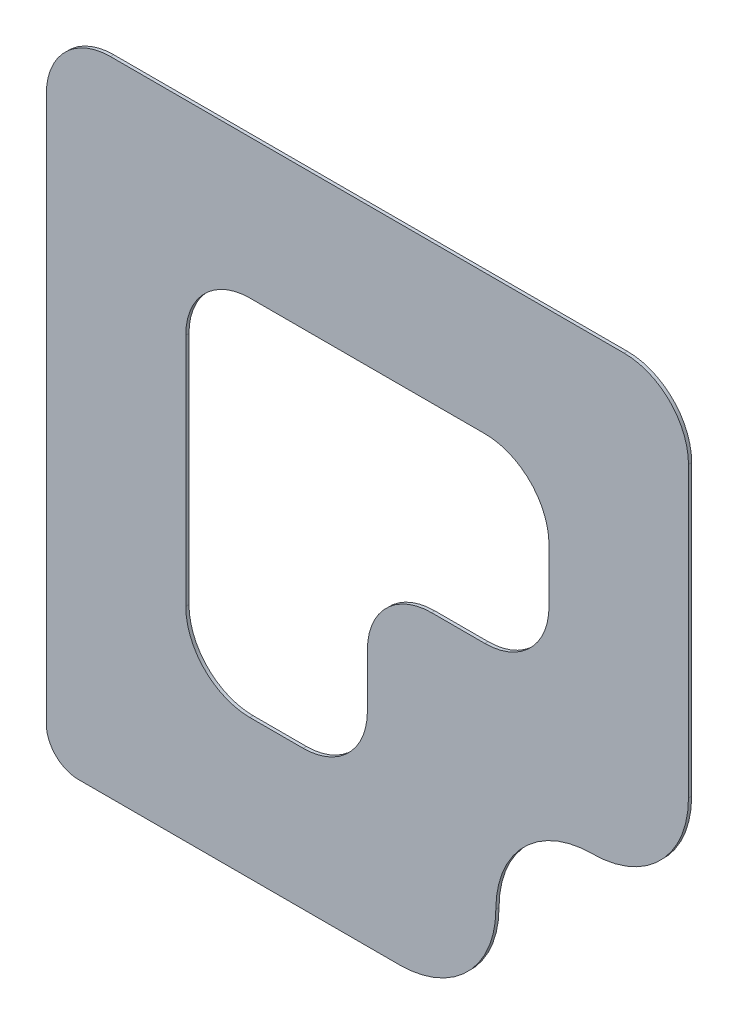
ISO-10303-21;
HEADER;
FILE_DESCRIPTION(('STEP AP214'),'2;1');
FILE_NAME('part.step','',(''),(''),'','','');
FILE_SCHEMA(('AUTOMOTIVE_DESIGN { 1 0 10303 214 1 1 1 1 }'));
ENDSEC;
DATA;
#1=APPLICATION_CONTEXT('core data for automotive mechanical design processes');
#2=APPLICATION_PROTOCOL_DEFINITION('international standard','automotive_design',2000,#1);
#3=PRODUCT_CONTEXT('',#1,'mechanical');
#4=PRODUCT('Part','Part','',(#3));
#5=PRODUCT_RELATED_PRODUCT_CATEGORY('part','',(#4));
#6=PRODUCT_DEFINITION_FORMATION('','',#4);
#7=PRODUCT_DEFINITION_CONTEXT('part definition',#1,'design');
#8=PRODUCT_DEFINITION('design','',#6,#7);
#9=PRODUCT_DEFINITION_SHAPE('','',#8);
#10=(LENGTH_UNIT() NAMED_UNIT(*) SI_UNIT(.MILLI.,.METRE.));
#11=(NAMED_UNIT(*) PLANE_ANGLE_UNIT() SI_UNIT($,.RADIAN.));
#12=(NAMED_UNIT(*) SI_UNIT($,.STERADIAN.) SOLID_ANGLE_UNIT());
#13=UNCERTAINTY_MEASURE_WITH_UNIT(LENGTH_MEASURE(1.E-05),#10,'distance_accuracy_value','');
#14=(GEOMETRIC_REPRESENTATION_CONTEXT(3) GLOBAL_UNCERTAINTY_ASSIGNED_CONTEXT((#13)) GLOBAL_UNIT_ASSIGNED_CONTEXT((#10,
#11,#12)) REPRESENTATION_CONTEXT('',''));
#15=CARTESIAN_POINT('',(0.,0.,0.));
#16=DIRECTION('',(0.,0.,1.));
#17=DIRECTION('',(1.,0.,0.));
#18=AXIS2_PLACEMENT_3D('',#15,#16,#17);
#19=CARTESIAN_POINT('',(20.5,23.,0.1));
#20=DIRECTION('',(0.,0.,1.));
#21=DIRECTION('',(1.,0.,0.));
#22=AXIS2_PLACEMENT_3D('',#19,#20,#21);
#23=PLANE('',#22);
#24=CARTESIAN_POINT('',(20.5,23.,0.1));
#25=DIRECTION('',(0.,0.,1.));
#26=DIRECTION('',(1.,0.,0.));
#27=AXIS2_PLACEMENT_3D('',#24,#25,#26);
#28=CIRCLE('',#27,1.);
#29=CARTESIAN_POINT('',(19.5,23.,0.1));
#30=VERTEX_POINT('',#29);
#31=CARTESIAN_POINT('',(20.5,22.,0.1));
#32=VERTEX_POINT('',#31);
#33=EDGE_CURVE('E275',#30,#32,#28,.T.);
#34=ORIENTED_EDGE('',*,*,#33,.T.);
#35=DIRECTION('',(1.,0.,0.));
#36=VECTOR('',#35,1.);
#37=CARTESIAN_POINT('',(20.5,22.,0.1));
#38=LINE('',#37,#36);
#39=CARTESIAN_POINT('',(30.5,22.,0.1));
#40=VERTEX_POINT('',#39);
#41=EDGE_CURVE('E278',#32,#40,#38,.T.);
#42=ORIENTED_EDGE('',*,*,#41,.T.);
#43=CARTESIAN_POINT('',(30.5,25.,0.1));
#44=DIRECTION('',(0.,0.,1.));
#45=DIRECTION('',(1.,0.,0.));
#46=AXIS2_PLACEMENT_3D('',#43,#44,#45);
#47=CIRCLE('',#46,3.);
#48=CARTESIAN_POINT('',(33.5,25.,0.1));
#49=VERTEX_POINT('',#48);
#50=EDGE_CURVE('E281',#40,#49,#47,.T.);
#51=ORIENTED_EDGE('',*,*,#50,.T.);
#52=CARTESIAN_POINT('',(36.5,25.,0.1));
#53=DIRECTION('',(0.,0.,-1.));
#54=DIRECTION('',(1.,0.,0.));
#55=AXIS2_PLACEMENT_3D('',#52,#53,#54);
#56=CIRCLE('',#55,3.);
#57=CARTESIAN_POINT('',(36.5,28.,0.1));
#58=VERTEX_POINT('',#57);
#59=EDGE_CURVE('E283',#49,#58,#56,.T.);
#60=ORIENTED_EDGE('',*,*,#59,.T.);
#61=CARTESIAN_POINT('',(36.5,31.,0.1));
#62=DIRECTION('',(0.,0.,1.));
#63=DIRECTION('',(1.,0.,0.));
#64=AXIS2_PLACEMENT_3D('',#61,#62,#63);
#65=CIRCLE('',#64,3.);
#66=CARTESIAN_POINT('',(39.5,31.,0.1));
#67=VERTEX_POINT('',#66);
#68=EDGE_CURVE('E285',#58,#67,#65,.T.);
#69=ORIENTED_EDGE('',*,*,#68,.T.);
#70=DIRECTION('',(0.,1.,0.));
#71=VECTOR('',#70,1.);
#72=CARTESIAN_POINT('',(39.5,31.,0.1));
#73=LINE('',#72,#71);
#74=CARTESIAN_POINT('',(39.5,40.,0.1));
#75=VERTEX_POINT('',#74);
#76=EDGE_CURVE('E287',#67,#75,#73,.T.);
#77=ORIENTED_EDGE('',*,*,#76,.T.);
#78=CARTESIAN_POINT('',(37.5,40.,0.1));
#79=DIRECTION('',(0.,0.,1.));
#80=DIRECTION('',(1.,0.,0.));
#81=AXIS2_PLACEMENT_3D('',#78,#79,#80);
#82=CIRCLE('',#81,2.);
#83=CARTESIAN_POINT('',(37.5,42.,0.1));
#84=VERTEX_POINT('',#83);
#85=EDGE_CURVE('E289',#75,#84,#82,.T.);
#86=ORIENTED_EDGE('',*,*,#85,.T.);
#87=DIRECTION('',(-1.,0.,0.));
#88=VECTOR('',#87,1.);
#89=CARTESIAN_POINT('',(37.5,42.,0.1));
#90=LINE('',#89,#88);
#91=CARTESIAN_POINT('',(21.5,42.,0.1));
#92=VERTEX_POINT('',#91);
#93=EDGE_CURVE('E291',#84,#92,#90,.T.);
#94=ORIENTED_EDGE('',*,*,#93,.T.);
#95=CARTESIAN_POINT('',(21.5,40.,0.1));
#96=DIRECTION('',(0.,0.,1.));
#97=DIRECTION('',(1.,0.,0.));
#98=AXIS2_PLACEMENT_3D('',#95,#96,#97);
#99=CIRCLE('',#98,2.);
#100=CARTESIAN_POINT('',(19.5,40.,0.1));
#101=VERTEX_POINT('',#100);
#102=EDGE_CURVE('E293',#92,#101,#99,.T.);
#103=ORIENTED_EDGE('',*,*,#102,.T.);
#104=DIRECTION('',(0.,-1.,0.));
#105=VECTOR('',#104,1.);
#106=CARTESIAN_POINT('',(19.5,40.,0.1));
#107=LINE('',#106,#105);
#108=EDGE_CURVE('E295',#101,#30,#107,.T.);
#109=ORIENTED_EDGE('',*,*,#108,.T.);
#110=EDGE_LOOP('',(#34,#42,#51,#60,#69,#77,#86,#94,#103,#109));
#111=FACE_BOUND('',#110,.T.);
#112=DIRECTION('',(0.,-1.,0.));
#113=VECTOR('',#112,1.);
#114=CARTESIAN_POINT('',(23.8431457505076,35.6568542494924,0.1));
#115=LINE('',#114,#113);
#116=CARTESIAN_POINT('',(23.8431457505076,35.6568542494924,0.1));
#117=VERTEX_POINT('',#116);
#118=CARTESIAN_POINT('',(23.8431457505076,28.3431457505076,0.1));
#119=VERTEX_POINT('',#118);
#120=EDGE_CURVE('E190',#117,#119,#115,.T.);
#121=ORIENTED_EDGE('',*,*,#120,.F.);
#122=CARTESIAN_POINT('',(25.8431457505076,35.6568542494924,0.1));
#123=DIRECTION('',(0.,0.,1.));
#124=DIRECTION('',(1.,0.,0.));
#125=AXIS2_PLACEMENT_3D('',#122,#123,#124);
#126=CIRCLE('',#125,2.);
#127=CARTESIAN_POINT('',(25.8431457505076,37.6568542494924,0.1));
#128=VERTEX_POINT('',#127);
#129=EDGE_CURVE('E182',#128,#117,#126,.T.);
#130=ORIENTED_EDGE('',*,*,#129,.F.);
#131=DIRECTION('',(-1.,0.,0.));
#132=VECTOR('',#131,1.);
#133=CARTESIAN_POINT('',(33.1568542494924,37.6568542494924,0.1));
#134=LINE('',#133,#132);
#135=CARTESIAN_POINT('',(33.1568542494924,37.6568542494924,0.1));
#136=VERTEX_POINT('',#135);
#137=EDGE_CURVE('E223',#136,#128,#134,.T.);
#138=ORIENTED_EDGE('',*,*,#137,.F.);
#139=CARTESIAN_POINT('',(33.1568542494924,35.6568542494924,0.1));
#140=DIRECTION('',(0.,0.,1.));
#141=DIRECTION('',(1.,0.,0.));
#142=AXIS2_PLACEMENT_3D('',#139,#140,#141);
#143=CIRCLE('',#142,2.);
#144=CARTESIAN_POINT('',(35.1568542494924,35.6568542494924,0.1));
#145=VERTEX_POINT('',#144);
#146=EDGE_CURVE('E221',#145,#136,#143,.T.);
#147=ORIENTED_EDGE('',*,*,#146,.F.);
#148=DIRECTION('',(0.,1.,0.));
#149=VECTOR('',#148,1.);
#150=CARTESIAN_POINT('',(35.1568542494924,34.,0.1));
#151=LINE('',#150,#149);
#152=CARTESIAN_POINT('',(35.1568542494924,34.,0.1));
#153=VERTEX_POINT('',#152);
#154=EDGE_CURVE('E219',#153,#145,#151,.T.);
#155=ORIENTED_EDGE('',*,*,#154,.F.);
#156=CARTESIAN_POINT('',(33.1568542494924,34.,0.1));
#157=DIRECTION('',(0.,0.,1.));
#158=DIRECTION('',(1.,0.,0.));
#159=AXIS2_PLACEMENT_3D('',#156,#157,#158);
#160=CIRCLE('',#159,2.);
#161=CARTESIAN_POINT('',(33.1568542494924,32.,0.1));
#162=VERTEX_POINT('',#161);
#163=EDGE_CURVE('E217',#162,#153,#160,.T.);
#164=ORIENTED_EDGE('',*,*,#163,.F.);
#165=DIRECTION('',(1.,0.,0.));
#166=VECTOR('',#165,1.);
#167=CARTESIAN_POINT('',(31.5,32.,0.1));
#168=LINE('',#167,#166);
#169=CARTESIAN_POINT('',(31.5,32.,0.1));
#170=VERTEX_POINT('',#169);
#171=EDGE_CURVE('E215',#170,#162,#168,.T.);
#172=ORIENTED_EDGE('',*,*,#171,.F.);
#173=CARTESIAN_POINT('',(31.5,30.,0.1));
#174=DIRECTION('',(0.,0.,-1.));
#175=DIRECTION('',(1.,0.,0.));
#176=AXIS2_PLACEMENT_3D('',#173,#174,#175);
#177=CIRCLE('',#176,2.);
#178=CARTESIAN_POINT('',(29.5,30.,0.1));
#179=VERTEX_POINT('',#178);
#180=EDGE_CURVE('E213',#179,#170,#177,.T.);
#181=ORIENTED_EDGE('',*,*,#180,.F.);
#182=DIRECTION('',(0.,1.,0.));
#183=VECTOR('',#182,1.);
#184=CARTESIAN_POINT('',(29.5,30.,0.1));
#185=LINE('',#184,#183);
#186=CARTESIAN_POINT('',(29.5,28.3431457505076,0.1));
#187=VERTEX_POINT('',#186);
#188=EDGE_CURVE('E211',#187,#179,#185,.T.);
#189=ORIENTED_EDGE('',*,*,#188,.F.);
#190=CARTESIAN_POINT('',(27.5,28.3431457505076,0.1));
#191=DIRECTION('',(0.,0.,1.));
#192=DIRECTION('',(1.,0.,0.));
#193=AXIS2_PLACEMENT_3D('',#190,#191,#192);
#194=CIRCLE('',#193,2.);
#195=CARTESIAN_POINT('',(27.5,26.3431457505076,0.1));
#196=VERTEX_POINT('',#195);
#197=EDGE_CURVE('E209',#196,#187,#194,.T.);
#198=ORIENTED_EDGE('',*,*,#197,.F.);
#199=DIRECTION('',(1.,0.,0.));
#200=VECTOR('',#199,1.);
#201=CARTESIAN_POINT('',(25.8431457505076,26.3431457505076,0.1));
#202=LINE('',#201,#200);
#203=CARTESIAN_POINT('',(25.8431457505076,26.3431457505076,0.1));
#204=VERTEX_POINT('',#203);
#205=EDGE_CURVE('E205',#204,#196,#202,.T.);
#206=ORIENTED_EDGE('',*,*,#205,.F.);
#207=CARTESIAN_POINT('',(25.8431457505076,28.3431457505076,0.1));
#208=DIRECTION('',(0.,0.,1.));
#209=DIRECTION('',(1.,0.,0.));
#210=AXIS2_PLACEMENT_3D('',#207,#208,#209);
#211=CIRCLE('',#210,2.);
#212=EDGE_CURVE('E203',#119,#204,#211,.T.);
#213=ORIENTED_EDGE('',*,*,#212,.F.);
#214=EDGE_LOOP('',(#121,#130,#138,#147,#155,#164,#172,#181,#189,#198,#206,#213));
#215=FACE_BOUND('',#214,.T.);
#216=ADVANCED_FACE('F33',(#111,#215),#23,.T.);
#217=CARTESIAN_POINT('',(20.5,23.,0.));
#218=DIRECTION('',(0.,0.,1.));
#219=DIRECTION('',(1.,0.,0.));
#220=AXIS2_PLACEMENT_3D('',#217,#218,#219);
#221=PLANE('',#220);
#222=CARTESIAN_POINT('',(20.5,23.,0.));
#223=DIRECTION('',(0.,0.,1.));
#224=DIRECTION('',(1.,0.,0.));
#225=AXIS2_PLACEMENT_3D('',#222,#223,#224);
#226=CIRCLE('',#225,1.);
#227=CARTESIAN_POINT('',(19.5,23.,0.));
#228=VERTEX_POINT('',#227);
#229=CARTESIAN_POINT('',(20.5,22.,0.));
#230=VERTEX_POINT('',#229);
#231=EDGE_CURVE('E198',#228,#230,#226,.T.);
#232=ORIENTED_EDGE('',*,*,#231,.F.);
#233=DIRECTION('',(0.,-1.,0.));
#234=VECTOR('',#233,1.);
#235=CARTESIAN_POINT('',(19.5,40.,0.));
#236=LINE('',#235,#234);
#237=CARTESIAN_POINT('',(19.5,40.,0.));
#238=VERTEX_POINT('',#237);
#239=EDGE_CURVE('E279',#238,#228,#236,.T.);
#240=ORIENTED_EDGE('',*,*,#239,.F.);
#241=CARTESIAN_POINT('',(21.5,40.,0.));
#242=DIRECTION('',(0.,0.,1.));
#243=DIRECTION('',(1.,0.,0.));
#244=AXIS2_PLACEMENT_3D('',#241,#242,#243);
#245=CIRCLE('',#244,2.);
#246=CARTESIAN_POINT('',(21.5,42.,0.));
#247=VERTEX_POINT('',#246);
#248=EDGE_CURVE('E315',#247,#238,#245,.T.);
#249=ORIENTED_EDGE('',*,*,#248,.F.);
#250=DIRECTION('',(-1.,0.,0.));
#251=VECTOR('',#250,1.);
#252=CARTESIAN_POINT('',(37.5,42.,0.));
#253=LINE('',#252,#251);
#254=CARTESIAN_POINT('',(37.5,42.,0.));
#255=VERTEX_POINT('',#254);
#256=EDGE_CURVE('E313',#255,#247,#253,.T.);
#257=ORIENTED_EDGE('',*,*,#256,.F.);
#258=CARTESIAN_POINT('',(37.5,40.,0.));
#259=DIRECTION('',(0.,0.,1.));
#260=DIRECTION('',(1.,0.,0.));
#261=AXIS2_PLACEMENT_3D('',#258,#259,#260);
#262=CIRCLE('',#261,2.);
#263=CARTESIAN_POINT('',(39.5,40.,0.));
#264=VERTEX_POINT('',#263);
#265=EDGE_CURVE('E311',#264,#255,#262,.T.);
#266=ORIENTED_EDGE('',*,*,#265,.F.);
#267=DIRECTION('',(0.,1.,0.));
#268=VECTOR('',#267,1.);
#269=CARTESIAN_POINT('',(39.5,33.,0.));
#270=LINE('',#269,#268);
#271=CARTESIAN_POINT('',(39.5,31.,0.));
#272=VERTEX_POINT('',#271);
#273=EDGE_CURVE('E309',#272,#264,#270,.T.);
#274=ORIENTED_EDGE('',*,*,#273,.F.);
#275=CARTESIAN_POINT('',(36.5,31.,0.));
#276=DIRECTION('',(0.,0.,1.));
#277=DIRECTION('',(1.,0.,0.));
#278=AXIS2_PLACEMENT_3D('',#275,#276,#277);
#279=CIRCLE('',#278,3.);
#280=CARTESIAN_POINT('',(36.5,28.,0.));
#281=VERTEX_POINT('',#280);
#282=EDGE_CURVE('E306',#281,#272,#279,.T.);
#283=ORIENTED_EDGE('',*,*,#282,.F.);
#284=CARTESIAN_POINT('',(36.5,25.,0.));
#285=DIRECTION('',(0.,0.,-1.));
#286=DIRECTION('',(1.,0.,0.));
#287=AXIS2_PLACEMENT_3D('',#284,#285,#286);
#288=CIRCLE('',#287,3.);
#289=CARTESIAN_POINT('',(33.5,25.,0.));
#290=VERTEX_POINT('',#289);
#291=EDGE_CURVE('E304',#290,#281,#288,.T.);
#292=ORIENTED_EDGE('',*,*,#291,.F.);
#293=CARTESIAN_POINT('',(30.5,25.,0.));
#294=DIRECTION('',(0.,0.,1.));
#295=DIRECTION('',(1.,0.,0.));
#296=AXIS2_PLACEMENT_3D('',#293,#294,#295);
#297=CIRCLE('',#296,3.);
#298=CARTESIAN_POINT('',(30.5,22.,0.));
#299=VERTEX_POINT('',#298);
#300=EDGE_CURVE('E302',#299,#290,#297,.T.);
#301=ORIENTED_EDGE('',*,*,#300,.F.);
#302=DIRECTION('',(1.,0.,0.));
#303=VECTOR('',#302,1.);
#304=CARTESIAN_POINT('',(30.5,22.,0.));
#305=LINE('',#304,#303);
#306=EDGE_CURVE('E300',#230,#299,#305,.T.);
#307=ORIENTED_EDGE('',*,*,#306,.F.);
#308=EDGE_LOOP('',(#232,#240,#249,#257,#266,#274,#283,#292,#301,#307));
#309=FACE_BOUND('',#308,.T.);
#310=CARTESIAN_POINT('',(25.8431457505076,35.6568542494924,0.));
#311=DIRECTION('',(0.,0.,1.));
#312=DIRECTION('',(1.,0.,0.));
#313=AXIS2_PLACEMENT_3D('',#310,#311,#312);
#314=CIRCLE('',#313,2.);
#315=CARTESIAN_POINT('',(25.8431457505076,37.6568542494924,0.));
#316=VERTEX_POINT('',#315);
#317=CARTESIAN_POINT('',(23.8431457505076,35.6568542494924,0.));
#318=VERTEX_POINT('',#317);
#319=EDGE_CURVE('E56',#316,#318,#314,.T.);
#320=ORIENTED_EDGE('',*,*,#319,.T.);
#321=DIRECTION('',(0.,-1.,0.));
#322=VECTOR('',#321,1.);
#323=CARTESIAN_POINT('',(23.8431457505076,35.6568542494924,0.));
#324=LINE('',#323,#322);
#325=CARTESIAN_POINT('',(23.8431457505076,28.3431457505076,0.));
#326=VERTEX_POINT('',#325);
#327=EDGE_CURVE('E197',#318,#326,#324,.T.);
#328=ORIENTED_EDGE('',*,*,#327,.T.);
#329=CARTESIAN_POINT('',(25.8431457505076,28.3431457505076,0.));
#330=DIRECTION('',(0.,0.,1.));
#331=DIRECTION('',(1.,0.,0.));
#332=AXIS2_PLACEMENT_3D('',#329,#330,#331);
#333=CIRCLE('',#332,2.);
#334=CARTESIAN_POINT('',(25.8431457505076,26.3431457505076,0.));
#335=VERTEX_POINT('',#334);
#336=EDGE_CURVE('E227',#326,#335,#333,.T.);
#337=ORIENTED_EDGE('',*,*,#336,.T.);
#338=DIRECTION('',(1.,0.,0.));
#339=VECTOR('',#338,1.);
#340=CARTESIAN_POINT('',(25.8431457505076,26.3431457505076,0.));
#341=LINE('',#340,#339);
#342=CARTESIAN_POINT('',(27.5,26.3431457505076,0.));
#343=VERTEX_POINT('',#342);
#344=EDGE_CURVE('E230',#335,#343,#341,.T.);
#345=ORIENTED_EDGE('',*,*,#344,.T.);
#346=CARTESIAN_POINT('',(27.5,28.3431457505076,0.));
#347=DIRECTION('',(0.,0.,1.));
#348=DIRECTION('',(1.,0.,0.));
#349=AXIS2_PLACEMENT_3D('',#346,#347,#348);
#350=CIRCLE('',#349,2.);
#351=CARTESIAN_POINT('',(29.5,28.3431457505076,0.));
#352=VERTEX_POINT('',#351);
#353=EDGE_CURVE('E233',#343,#352,#350,.T.);
#354=ORIENTED_EDGE('',*,*,#353,.T.);
#355=DIRECTION('',(0.,1.,0.));
#356=VECTOR('',#355,1.);
#357=CARTESIAN_POINT('',(29.5,30.,0.));
#358=LINE('',#357,#356);
#359=CARTESIAN_POINT('',(29.5,30.,0.));
#360=VERTEX_POINT('',#359);
#361=EDGE_CURVE('E236',#352,#360,#358,.T.);
#362=ORIENTED_EDGE('',*,*,#361,.T.);
#363=CARTESIAN_POINT('',(31.5,30.,0.));
#364=DIRECTION('',(0.,0.,-1.));
#365=DIRECTION('',(1.,0.,0.));
#366=AXIS2_PLACEMENT_3D('',#363,#364,#365);
#367=CIRCLE('',#366,2.);
#368=CARTESIAN_POINT('',(31.5,32.,0.));
#369=VERTEX_POINT('',#368);
#370=EDGE_CURVE('E239',#360,#369,#367,.T.);
#371=ORIENTED_EDGE('',*,*,#370,.T.);
#372=DIRECTION('',(1.,0.,0.));
#373=VECTOR('',#372,1.);
#374=CARTESIAN_POINT('',(31.5,32.,0.));
#375=LINE('',#374,#373);
#376=CARTESIAN_POINT('',(33.1568542494924,32.,0.));
#377=VERTEX_POINT('',#376);
#378=EDGE_CURVE('E242',#369,#377,#375,.T.);
#379=ORIENTED_EDGE('',*,*,#378,.T.);
#380=CARTESIAN_POINT('',(33.1568542494924,34.,0.));
#381=DIRECTION('',(0.,0.,1.));
#382=DIRECTION('',(1.,0.,0.));
#383=AXIS2_PLACEMENT_3D('',#380,#381,#382);
#384=CIRCLE('',#383,2.);
#385=CARTESIAN_POINT('',(35.1568542494924,34.,0.));
#386=VERTEX_POINT('',#385);
#387=EDGE_CURVE('E245',#377,#386,#384,.T.);
#388=ORIENTED_EDGE('',*,*,#387,.T.);
#389=DIRECTION('',(0.,1.,0.));
#390=VECTOR('',#389,1.);
#391=CARTESIAN_POINT('',(35.1568542494924,34.,0.));
#392=LINE('',#391,#390);
#393=CARTESIAN_POINT('',(35.1568542494924,35.6568542494924,0.));
#394=VERTEX_POINT('',#393);
#395=EDGE_CURVE('E248',#386,#394,#392,.T.);
#396=ORIENTED_EDGE('',*,*,#395,.T.);
#397=CARTESIAN_POINT('',(33.1568542494924,35.6568542494924,0.));
#398=DIRECTION('',(0.,0.,1.));
#399=DIRECTION('',(1.,0.,0.));
#400=AXIS2_PLACEMENT_3D('',#397,#398,#399);
#401=CIRCLE('',#400,2.);
#402=CARTESIAN_POINT('',(33.1568542494924,37.6568542494924,0.));
#403=VERTEX_POINT('',#402);
#404=EDGE_CURVE('E251',#394,#403,#401,.T.);
#405=ORIENTED_EDGE('',*,*,#404,.T.);
#406=DIRECTION('',(-1.,0.,0.));
#407=VECTOR('',#406,1.);
#408=CARTESIAN_POINT('',(33.1568542494924,37.6568542494924,0.));
#409=LINE('',#408,#407);
#410=EDGE_CURVE('E191',#403,#316,#409,.T.);
#411=ORIENTED_EDGE('',*,*,#410,.T.);
#412=EDGE_LOOP('',(#320,#328,#337,#345,#354,#362,#371,#379,#388,#396,#405,#411));
#413=FACE_BOUND('',#412,.T.);
#414=ADVANCED_FACE('F351',(#309,#413),#221,.F.);
#415=CARTESIAN_POINT('',(20.5,23.,0.1));
#416=DIRECTION('',(0.,0.,-1.));
#417=DIRECTION('',(-1.,0.,0.));
#418=AXIS2_PLACEMENT_3D('',#415,#416,#417);
#419=CYLINDRICAL_SURFACE('',#418,1.);
#420=ORIENTED_EDGE('',*,*,#231,.T.);
#421=DIRECTION('',(0.,0.,-1.));
#422=VECTOR('',#421,1.);
#423=CARTESIAN_POINT('',(20.5,22.,0.1));
#424=LINE('',#423,#422);
#425=EDGE_CURVE('E11',#32,#230,#424,.T.);
#426=ORIENTED_EDGE('',*,*,#425,.F.);
#427=ORIENTED_EDGE('',*,*,#33,.F.);
#428=DIRECTION('',(0.,0.,-1.));
#429=VECTOR('',#428,1.);
#430=CARTESIAN_POINT('',(19.5,23.,0.1));
#431=LINE('',#430,#429);
#432=EDGE_CURVE('E297',#30,#228,#431,.T.);
#433=ORIENTED_EDGE('',*,*,#432,.T.);
#434=EDGE_LOOP('',(#420,#426,#427,#433));
#435=FACE_BOUND('',#434,.T.);
#436=ADVANCED_FACE('F35',(#435),#419,.T.);
#437=CARTESIAN_POINT('',(30.5,22.,0.1));
#438=DIRECTION('',(0.,1.,0.));
#439=DIRECTION('',(0.,0.,1.));
#440=AXIS2_PLACEMENT_3D('',#437,#438,#439);
#441=PLANE('',#440);
#442=ORIENTED_EDGE('',*,*,#306,.T.);
#443=DIRECTION('',(0.,0.,-1.));
#444=VECTOR('',#443,1.);
#445=CARTESIAN_POINT('',(30.5,22.,0.1));
#446=LINE('',#445,#444);
#447=EDGE_CURVE('E41',#40,#299,#446,.T.);
#448=ORIENTED_EDGE('',*,*,#447,.F.);
#449=ORIENTED_EDGE('',*,*,#41,.F.);
#450=ORIENTED_EDGE('',*,*,#425,.T.);
#451=EDGE_LOOP('',(#442,#448,#449,#450));
#452=FACE_BOUND('',#451,.T.);
#453=ADVANCED_FACE('F367',(#452),#441,.F.);
#454=CARTESIAN_POINT('',(30.5,25.,0.1));
#455=DIRECTION('',(0.,0.,-1.));
#456=DIRECTION('',(-1.,0.,0.));
#457=AXIS2_PLACEMENT_3D('',#454,#455,#456);
#458=CYLINDRICAL_SURFACE('',#457,3.);
#459=ORIENTED_EDGE('',*,*,#300,.T.);
#460=DIRECTION('',(0.,0.,-1.));
#461=VECTOR('',#460,1.);
#462=CARTESIAN_POINT('',(33.5,25.,0.1));
#463=LINE('',#462,#461);
#464=EDGE_CURVE('E338',#49,#290,#463,.T.);
#465=ORIENTED_EDGE('',*,*,#464,.F.);
#466=ORIENTED_EDGE('',*,*,#50,.F.);
#467=ORIENTED_EDGE('',*,*,#447,.T.);
#468=EDGE_LOOP('',(#459,#465,#466,#467));
#469=FACE_BOUND('',#468,.T.);
#470=ADVANCED_FACE('F345',(#469),#458,.T.);
#471=CARTESIAN_POINT('',(36.5,25.,0.1));
#472=DIRECTION('',(0.,0.,-1.));
#473=DIRECTION('',(-1.,0.,0.));
#474=AXIS2_PLACEMENT_3D('',#471,#472,#473);
#475=CYLINDRICAL_SURFACE('',#474,3.);
#476=ORIENTED_EDGE('',*,*,#291,.T.);
#477=DIRECTION('',(0.,0.,-1.));
#478=VECTOR('',#477,1.);
#479=CARTESIAN_POINT('',(36.5,28.,0.1));
#480=LINE('',#479,#478);
#481=EDGE_CURVE('E335',#58,#281,#480,.T.);
#482=ORIENTED_EDGE('',*,*,#481,.F.);
#483=ORIENTED_EDGE('',*,*,#59,.F.);
#484=ORIENTED_EDGE('',*,*,#464,.T.);
#485=EDGE_LOOP('',(#476,#482,#483,#484));
#486=FACE_BOUND('',#485,.T.);
#487=ADVANCED_FACE('F356',(#486),#475,.F.);
#488=CARTESIAN_POINT('',(36.5,31.,0.1));
#489=DIRECTION('',(0.,0.,-1.));
#490=DIRECTION('',(-1.,0.,0.));
#491=AXIS2_PLACEMENT_3D('',#488,#489,#490);
#492=CYLINDRICAL_SURFACE('',#491,3.);
#493=ORIENTED_EDGE('',*,*,#282,.T.);
#494=DIRECTION('',(0.,0.,-1.));
#495=VECTOR('',#494,1.);
#496=CARTESIAN_POINT('',(39.5,31.,0.1));
#497=LINE('',#496,#495);
#498=EDGE_CURVE('E332',#67,#272,#497,.T.);
#499=ORIENTED_EDGE('',*,*,#498,.F.);
#500=ORIENTED_EDGE('',*,*,#68,.F.);
#501=ORIENTED_EDGE('',*,*,#481,.T.);
#502=EDGE_LOOP('',(#493,#499,#500,#501));
#503=FACE_BOUND('',#502,.T.);
#504=ADVANCED_FACE('F360',(#503),#492,.T.);
#505=CARTESIAN_POINT('',(39.5,33.,0.1));
#506=DIRECTION('',(-1.,0.,0.));
#507=DIRECTION('',(0.,0.,1.));
#508=AXIS2_PLACEMENT_3D('',#505,#506,#507);
#509=PLANE('',#508);
#510=ORIENTED_EDGE('',*,*,#273,.T.);
#511=DIRECTION('',(0.,0.,-1.));
#512=VECTOR('',#511,1.);
#513=CARTESIAN_POINT('',(39.5,40.,0.1));
#514=LINE('',#513,#512);
#515=EDGE_CURVE('E329',#75,#264,#514,.T.);
#516=ORIENTED_EDGE('',*,*,#515,.F.);
#517=ORIENTED_EDGE('',*,*,#76,.F.);
#518=ORIENTED_EDGE('',*,*,#498,.T.);
#519=EDGE_LOOP('',(#510,#516,#517,#518));
#520=FACE_BOUND('',#519,.T.);
#521=ADVANCED_FACE('F390',(#520),#509,.F.);
#522=CARTESIAN_POINT('',(37.5,40.,0.1));
#523=DIRECTION('',(0.,0.,-1.));
#524=DIRECTION('',(-1.,0.,0.));
#525=AXIS2_PLACEMENT_3D('',#522,#523,#524);
#526=CYLINDRICAL_SURFACE('',#525,2.);
#527=ORIENTED_EDGE('',*,*,#265,.T.);
#528=DIRECTION('',(0.,0.,-1.));
#529=VECTOR('',#528,1.);
#530=CARTESIAN_POINT('',(37.5,42.,0.1));
#531=LINE('',#530,#529);
#532=EDGE_CURVE('E326',#84,#255,#531,.T.);
#533=ORIENTED_EDGE('',*,*,#532,.F.);
#534=ORIENTED_EDGE('',*,*,#85,.F.);
#535=ORIENTED_EDGE('',*,*,#515,.T.);
#536=EDGE_LOOP('',(#527,#533,#534,#535));
#537=FACE_BOUND('',#536,.T.);
#538=ADVANCED_FACE('F387',(#537),#526,.T.);
#539=CARTESIAN_POINT('',(37.5,42.,0.1));
#540=DIRECTION('',(0.,-1.,0.));
#541=DIRECTION('',(0.,0.,-1.));
#542=AXIS2_PLACEMENT_3D('',#539,#540,#541);
#543=PLANE('',#542);
#544=ORIENTED_EDGE('',*,*,#256,.T.);
#545=DIRECTION('',(0.,0.,-1.));
#546=VECTOR('',#545,1.);
#547=CARTESIAN_POINT('',(21.5,42.,0.1));
#548=LINE('',#547,#546);
#549=EDGE_CURVE('E323',#92,#247,#548,.T.);
#550=ORIENTED_EDGE('',*,*,#549,.F.);
#551=ORIENTED_EDGE('',*,*,#93,.F.);
#552=ORIENTED_EDGE('',*,*,#532,.T.);
#553=EDGE_LOOP('',(#544,#550,#551,#552));
#554=FACE_BOUND('',#553,.T.);
#555=ADVANCED_FACE('F383',(#554),#543,.F.);
#556=CARTESIAN_POINT('',(21.5,40.,0.1));
#557=DIRECTION('',(0.,0.,-1.));
#558=DIRECTION('',(-1.,0.,0.));
#559=AXIS2_PLACEMENT_3D('',#556,#557,#558);
#560=CYLINDRICAL_SURFACE('',#559,2.);
#561=ORIENTED_EDGE('',*,*,#248,.T.);
#562=DIRECTION('',(0.,0.,-1.));
#563=VECTOR('',#562,1.);
#564=CARTESIAN_POINT('',(19.5,40.,0.1));
#565=LINE('',#564,#563);
#566=EDGE_CURVE('E320',#101,#238,#565,.T.);
#567=ORIENTED_EDGE('',*,*,#566,.F.);
#568=ORIENTED_EDGE('',*,*,#102,.F.);
#569=ORIENTED_EDGE('',*,*,#549,.T.);
#570=EDGE_LOOP('',(#561,#567,#568,#569));
#571=FACE_BOUND('',#570,.T.);
#572=ADVANCED_FACE('F379',(#571),#560,.T.);
#573=CARTESIAN_POINT('',(19.5,40.,0.1));
#574=DIRECTION('',(1.,0.,0.));
#575=DIRECTION('',(0.,0.,-1.));
#576=AXIS2_PLACEMENT_3D('',#573,#574,#575);
#577=PLANE('',#576);
#578=ORIENTED_EDGE('',*,*,#239,.T.);
#579=ORIENTED_EDGE('',*,*,#432,.F.);
#580=ORIENTED_EDGE('',*,*,#108,.F.);
#581=ORIENTED_EDGE('',*,*,#566,.T.);
#582=EDGE_LOOP('',(#578,#579,#580,#581));
#583=FACE_BOUND('',#582,.T.);
#584=ADVANCED_FACE('F374',(#583),#577,.F.);
#585=CARTESIAN_POINT('',(25.8431457505076,35.6568542494924,0.1));
#586=DIRECTION('',(0.,0.,-1.));
#587=DIRECTION('',(-1.,0.,0.));
#588=AXIS2_PLACEMENT_3D('',#585,#586,#587);
#589=CYLINDRICAL_SURFACE('',#588,2.);
#590=ORIENTED_EDGE('',*,*,#319,.F.);
#591=DIRECTION('',(0.,0.,-1.));
#592=VECTOR('',#591,1.);
#593=CARTESIAN_POINT('',(25.8431457505076,37.6568542494924,0.1));
#594=LINE('',#593,#592);
#595=EDGE_CURVE('E186',#128,#316,#594,.T.);
#596=ORIENTED_EDGE('',*,*,#595,.F.);
#597=ORIENTED_EDGE('',*,*,#129,.T.);
#598=DIRECTION('',(0.,0.,-1.));
#599=VECTOR('',#598,1.);
#600=CARTESIAN_POINT('',(23.8431457505076,35.6568542494924,0.1));
#601=LINE('',#600,#599);
#602=EDGE_CURVE('E185',#117,#318,#601,.T.);
#603=ORIENTED_EDGE('',*,*,#602,.T.);
#604=EDGE_LOOP('',(#590,#596,#597,#603));
#605=FACE_BOUND('',#604,.T.);
#606=ADVANCED_FACE('F184',(#605),#589,.F.);
#607=CARTESIAN_POINT('',(23.8431457505076,35.6568542494924,0.1));
#608=DIRECTION('',(1.,0.,0.));
#609=DIRECTION('',(0.,1.,0.));
#610=AXIS2_PLACEMENT_3D('',#607,#608,#609);
#611=PLANE('',#610);
#612=ORIENTED_EDGE('',*,*,#327,.F.);
#613=ORIENTED_EDGE('',*,*,#602,.F.);
#614=ORIENTED_EDGE('',*,*,#120,.T.);
#615=DIRECTION('',(0.,0.,-1.));
#616=VECTOR('',#615,1.);
#617=CARTESIAN_POINT('',(23.8431457505076,28.3431457505076,0.1));
#618=LINE('',#617,#616);
#619=EDGE_CURVE('E199',#119,#326,#618,.T.);
#620=ORIENTED_EDGE('',*,*,#619,.T.);
#621=EDGE_LOOP('',(#612,#613,#614,#620));
#622=FACE_BOUND('',#621,.T.);
#623=ADVANCED_FACE('F194',(#622),#611,.T.);
#624=CARTESIAN_POINT('',(25.8431457505076,28.3431457505076,0.1));
#625=DIRECTION('',(0.,0.,-1.));
#626=DIRECTION('',(-1.,0.,0.));
#627=AXIS2_PLACEMENT_3D('',#624,#625,#626);
#628=CYLINDRICAL_SURFACE('',#627,2.);
#629=ORIENTED_EDGE('',*,*,#336,.F.);
#630=ORIENTED_EDGE('',*,*,#619,.F.);
#631=ORIENTED_EDGE('',*,*,#212,.T.);
#632=DIRECTION('',(0.,0.,-1.));
#633=VECTOR('',#632,1.);
#634=CARTESIAN_POINT('',(25.8431457505076,26.3431457505076,0.1));
#635=LINE('',#634,#633);
#636=EDGE_CURVE('E272',#204,#335,#635,.T.);
#637=ORIENTED_EDGE('',*,*,#636,.T.);
#638=EDGE_LOOP('',(#629,#630,#631,#637));
#639=FACE_BOUND('',#638,.T.);
#640=ADVANCED_FACE('F436',(#639),#628,.F.);
#641=CARTESIAN_POINT('',(25.8431457505076,26.3431457505076,0.1));
#642=DIRECTION('',(0.,1.,0.));
#643=DIRECTION('',(0.,0.,1.));
#644=AXIS2_PLACEMENT_3D('',#641,#642,#643);
#645=PLANE('',#644);
#646=ORIENTED_EDGE('',*,*,#344,.F.);
#647=ORIENTED_EDGE('',*,*,#636,.F.);
#648=ORIENTED_EDGE('',*,*,#205,.T.);
#649=DIRECTION('',(0.,0.,-1.));
#650=VECTOR('',#649,1.);
#651=CARTESIAN_POINT('',(27.5,26.3431457505076,0.1));
#652=LINE('',#651,#650);
#653=EDGE_CURVE('E270',#196,#343,#652,.T.);
#654=ORIENTED_EDGE('',*,*,#653,.T.);
#655=EDGE_LOOP('',(#646,#647,#648,#654));
#656=FACE_BOUND('',#655,.T.);
#657=ADVANCED_FACE('F442',(#656),#645,.T.);
#658=CARTESIAN_POINT('',(27.5,28.3431457505076,0.1));
#659=DIRECTION('',(0.,0.,-1.));
#660=DIRECTION('',(-1.,0.,0.));
#661=AXIS2_PLACEMENT_3D('',#658,#659,#660);
#662=CYLINDRICAL_SURFACE('',#661,2.);
#663=ORIENTED_EDGE('',*,*,#353,.F.);
#664=ORIENTED_EDGE('',*,*,#653,.F.);
#665=ORIENTED_EDGE('',*,*,#197,.T.);
#666=DIRECTION('',(0.,0.,-1.));
#667=VECTOR('',#666,1.);
#668=CARTESIAN_POINT('',(29.5,28.3431457505076,0.1));
#669=LINE('',#668,#667);
#670=EDGE_CURVE('E268',#187,#352,#669,.T.);
#671=ORIENTED_EDGE('',*,*,#670,.T.);
#672=EDGE_LOOP('',(#663,#664,#665,#671));
#673=FACE_BOUND('',#672,.T.);
#674=ADVANCED_FACE('F450',(#673),#662,.F.);
#675=CARTESIAN_POINT('',(29.5,30.,0.1));
#676=DIRECTION('',(-1.,0.,0.));
#677=DIRECTION('',(0.,0.,1.));
#678=AXIS2_PLACEMENT_3D('',#675,#676,#677);
#679=PLANE('',#678);
#680=ORIENTED_EDGE('',*,*,#361,.F.);
#681=ORIENTED_EDGE('',*,*,#670,.F.);
#682=ORIENTED_EDGE('',*,*,#188,.T.);
#683=DIRECTION('',(0.,0.,-1.));
#684=VECTOR('',#683,1.);
#685=CARTESIAN_POINT('',(29.5,30.,0.1));
#686=LINE('',#685,#684);
#687=EDGE_CURVE('E266',#179,#360,#686,.T.);
#688=ORIENTED_EDGE('',*,*,#687,.T.);
#689=EDGE_LOOP('',(#680,#681,#682,#688));
#690=FACE_BOUND('',#689,.T.);
#691=ADVANCED_FACE('F458',(#690),#679,.T.);
#692=CARTESIAN_POINT('',(31.5,30.,0.1));
#693=DIRECTION('',(0.,0.,-1.));
#694=DIRECTION('',(-1.,0.,0.));
#695=AXIS2_PLACEMENT_3D('',#692,#693,#694);
#696=CYLINDRICAL_SURFACE('',#695,2.);
#697=ORIENTED_EDGE('',*,*,#370,.F.);
#698=ORIENTED_EDGE('',*,*,#687,.F.);
#699=ORIENTED_EDGE('',*,*,#180,.T.);
#700=DIRECTION('',(0.,0.,-1.));
#701=VECTOR('',#700,1.);
#702=CARTESIAN_POINT('',(31.5,32.,0.1));
#703=LINE('',#702,#701);
#704=EDGE_CURVE('E264',#170,#369,#703,.T.);
#705=ORIENTED_EDGE('',*,*,#704,.T.);
#706=EDGE_LOOP('',(#697,#698,#699,#705));
#707=FACE_BOUND('',#706,.T.);
#708=ADVANCED_FACE('F466',(#707),#696,.T.);
#709=CARTESIAN_POINT('',(31.5,32.,0.1));
#710=DIRECTION('',(0.,1.,0.));
#711=DIRECTION('',(0.,0.,1.));
#712=AXIS2_PLACEMENT_3D('',#709,#710,#711);
#713=PLANE('',#712);
#714=ORIENTED_EDGE('',*,*,#378,.F.);
#715=ORIENTED_EDGE('',*,*,#704,.F.);
#716=ORIENTED_EDGE('',*,*,#171,.T.);
#717=DIRECTION('',(0.,0.,-1.));
#718=VECTOR('',#717,1.);
#719=CARTESIAN_POINT('',(33.1568542494924,32.,0.1));
#720=LINE('',#719,#718);
#721=EDGE_CURVE('E262',#162,#377,#720,.T.);
#722=ORIENTED_EDGE('',*,*,#721,.T.);
#723=EDGE_LOOP('',(#714,#715,#716,#722));
#724=FACE_BOUND('',#723,.T.);
#725=ADVANCED_FACE('F474',(#724),#713,.T.);
#726=CARTESIAN_POINT('',(33.1568542494924,34.,0.1));
#727=DIRECTION('',(0.,0.,-1.));
#728=DIRECTION('',(-1.,0.,0.));
#729=AXIS2_PLACEMENT_3D('',#726,#727,#728);
#730=CYLINDRICAL_SURFACE('',#729,2.);
#731=ORIENTED_EDGE('',*,*,#387,.F.);
#732=ORIENTED_EDGE('',*,*,#721,.F.);
#733=ORIENTED_EDGE('',*,*,#163,.T.);
#734=DIRECTION('',(0.,0.,-1.));
#735=VECTOR('',#734,1.);
#736=CARTESIAN_POINT('',(35.1568542494924,34.,0.1));
#737=LINE('',#736,#735);
#738=EDGE_CURVE('E260',#153,#386,#737,.T.);
#739=ORIENTED_EDGE('',*,*,#738,.T.);
#740=EDGE_LOOP('',(#731,#732,#733,#739));
#741=FACE_BOUND('',#740,.T.);
#742=ADVANCED_FACE('F482',(#741),#730,.F.);
#743=CARTESIAN_POINT('',(35.1568542494924,34.,0.1));
#744=DIRECTION('',(-1.,0.,0.));
#745=DIRECTION('',(0.,0.,1.));
#746=AXIS2_PLACEMENT_3D('',#743,#744,#745);
#747=PLANE('',#746);
#748=ORIENTED_EDGE('',*,*,#395,.F.);
#749=ORIENTED_EDGE('',*,*,#738,.F.);
#750=ORIENTED_EDGE('',*,*,#154,.T.);
#751=DIRECTION('',(0.,0.,-1.));
#752=VECTOR('',#751,1.);
#753=CARTESIAN_POINT('',(35.1568542494924,35.6568542494924,0.1));
#754=LINE('',#753,#752);
#755=EDGE_CURVE('E258',#145,#394,#754,.T.);
#756=ORIENTED_EDGE('',*,*,#755,.T.);
#757=EDGE_LOOP('',(#748,#749,#750,#756));
#758=FACE_BOUND('',#757,.T.);
#759=ADVANCED_FACE('F490',(#758),#747,.T.);
#760=CARTESIAN_POINT('',(33.1568542494924,35.6568542494924,0.1));
#761=DIRECTION('',(0.,0.,-1.));
#762=DIRECTION('',(-1.,0.,0.));
#763=AXIS2_PLACEMENT_3D('',#760,#761,#762);
#764=CYLINDRICAL_SURFACE('',#763,2.);
#765=ORIENTED_EDGE('',*,*,#404,.F.);
#766=ORIENTED_EDGE('',*,*,#755,.F.);
#767=ORIENTED_EDGE('',*,*,#146,.T.);
#768=DIRECTION('',(0.,0.,-1.));
#769=VECTOR('',#768,1.);
#770=CARTESIAN_POINT('',(33.1568542494924,37.6568542494924,0.1));
#771=LINE('',#770,#769);
#772=EDGE_CURVE('E48',#136,#403,#771,.T.);
#773=ORIENTED_EDGE('',*,*,#772,.T.);
#774=EDGE_LOOP('',(#765,#766,#767,#773));
#775=FACE_BOUND('',#774,.T.);
#776=ADVANCED_FACE('F498',(#775),#764,.F.);
#777=CARTESIAN_POINT('',(33.1568542494924,37.6568542494924,0.1));
#778=DIRECTION('',(0.,-1.,0.));
#779=DIRECTION('',(0.,0.,-1.));
#780=AXIS2_PLACEMENT_3D('',#777,#778,#779);
#781=PLANE('',#780);
#782=ORIENTED_EDGE('',*,*,#410,.F.);
#783=ORIENTED_EDGE('',*,*,#772,.F.);
#784=ORIENTED_EDGE('',*,*,#137,.T.);
#785=ORIENTED_EDGE('',*,*,#595,.T.);
#786=EDGE_LOOP('',(#782,#783,#784,#785));
#787=FACE_BOUND('',#786,.T.);
#788=ADVANCED_FACE('F506',(#787),#781,.T.);
#789=CLOSED_SHELL('',(#216,#414,#436,#453,#470,#487,#504,#521,#538,#555,#572,#584,#606,#623,
#640,#657,#674,#691,#708,#725,#742,#759,#776,#788));
#790=MANIFOLD_SOLID_BREP('B2',#789);
#791=ADVANCED_BREP_SHAPE_REPRESENTATION('',(#18,#790),#14);
#792=SHAPE_DEFINITION_REPRESENTATION(#9,#791);
ENDSEC;
END-ISO-10303-21;
